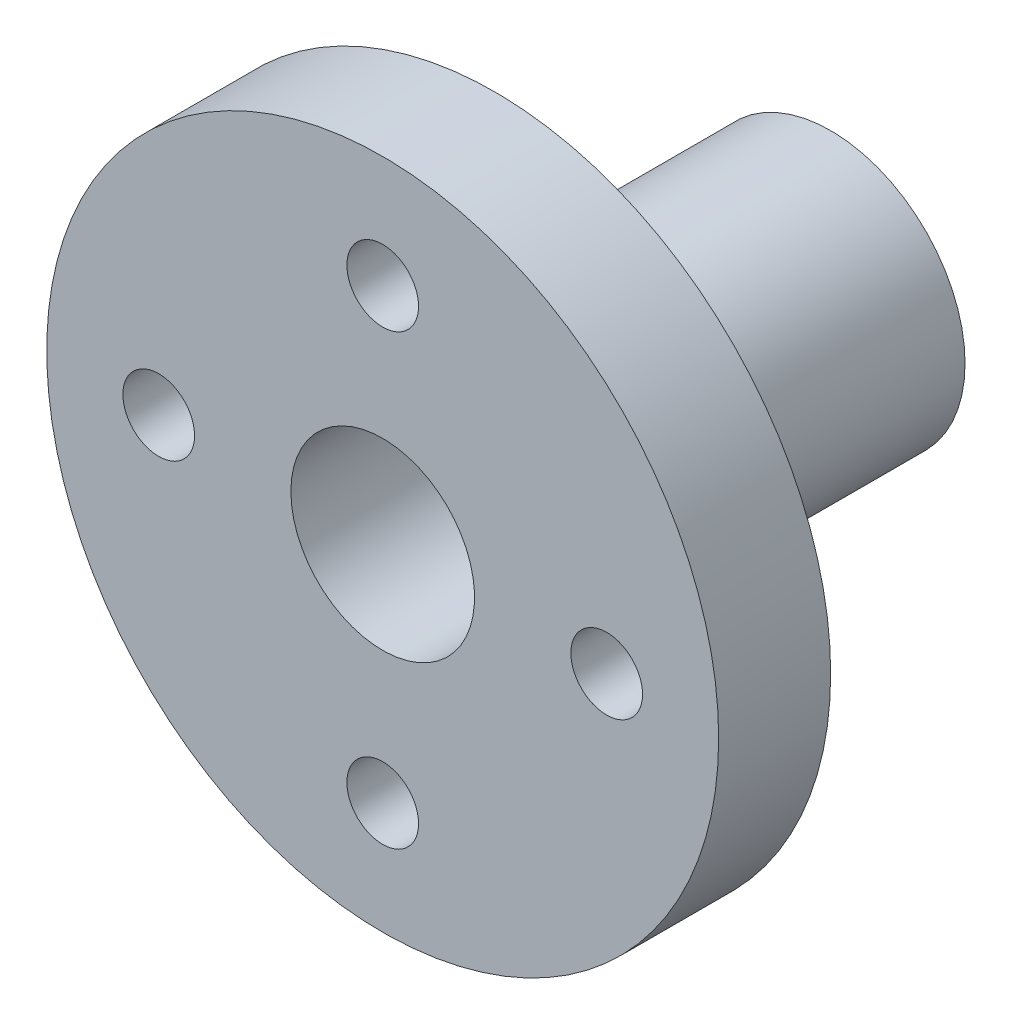
ISO-10303-21;
HEADER;
FILE_DESCRIPTION(('STEP AP214'),'2;1');
FILE_NAME('part.step','',(''),(''),'','','');
FILE_SCHEMA(('AUTOMOTIVE_DESIGN { 1 0 10303 214 1 1 1 1 }'));
ENDSEC;
DATA;
#1=APPLICATION_CONTEXT('core data for automotive mechanical design processes');
#2=APPLICATION_PROTOCOL_DEFINITION('international standard','automotive_design',2000,#1);
#3=PRODUCT_CONTEXT('',#1,'mechanical');
#4=PRODUCT('Part','Part','',(#3));
#5=PRODUCT_RELATED_PRODUCT_CATEGORY('part','',(#4));
#6=PRODUCT_DEFINITION_FORMATION('','',#4);
#7=PRODUCT_DEFINITION_CONTEXT('part definition',#1,'design');
#8=PRODUCT_DEFINITION('design','',#6,#7);
#9=PRODUCT_DEFINITION_SHAPE('','',#8);
#10=(LENGTH_UNIT() NAMED_UNIT(*) SI_UNIT(.MILLI.,.METRE.));
#11=(NAMED_UNIT(*) PLANE_ANGLE_UNIT() SI_UNIT($,.RADIAN.));
#12=(NAMED_UNIT(*) SI_UNIT($,.STERADIAN.) SOLID_ANGLE_UNIT());
#13=UNCERTAINTY_MEASURE_WITH_UNIT(LENGTH_MEASURE(1.E-05),#10,'distance_accuracy_value','');
#14=(GEOMETRIC_REPRESENTATION_CONTEXT(3) GLOBAL_UNCERTAINTY_ASSIGNED_CONTEXT((#13)) GLOBAL_UNIT_ASSIGNED_CONTEXT((#10,
#11,#12)) REPRESENTATION_CONTEXT('',''));
#15=CARTESIAN_POINT('',(0.,0.,0.));
#16=DIRECTION('',(0.,0.,1.));
#17=DIRECTION('',(1.,0.,0.));
#18=AXIS2_PLACEMENT_3D('',#15,#16,#17);
#19=CARTESIAN_POINT('',(-1.89397951347232,4.31163707788319,-15.));
#20=DIRECTION('',(0.,0.,1.));
#21=DIRECTION('',(1.,0.,0.));
#22=AXIS2_PLACEMENT_3D('',#19,#20,#21);
#23=CYLINDRICAL_SURFACE('',#22,6.);
#24=CARTESIAN_POINT('',(-1.89397951347232,-1.68836292211681,-6.89904165578189));
#25=CARTESIAN_POINT('',(-1.9821831581386,-1.68836159259811,-6.89903956223401));
#26=CARTESIAN_POINT('',(-2.07040924164979,-1.68639881141405,-6.89172356443015));
#27=CARTESIAN_POINT('',(-2.24431987455589,-1.67875951109007,-6.86270467119093));
#28=CARTESIAN_POINT('',(-2.33000318012759,-1.67308120477741,-6.840994852241));
#29=CARTESIAN_POINT('',(-2.49629278470857,-1.65863758813924,-6.78394432229066));
#30=CARTESIAN_POINT('',(-2.57690547428455,-1.64987625916019,-6.74862118564906));
#31=CARTESIAN_POINT('',(-2.73106246258645,-1.63019251532986,-6.66541186164861));
#32=CARTESIAN_POINT('',(-2.80460628983202,-1.61926995647686,-6.6175248370945));
#33=CARTESIAN_POINT('',(-2.94424311646434,-1.59615984133419,-6.50937484265115));
#34=CARTESIAN_POINT('',(-3.01014886536257,-1.58395066355161,-6.44887472137511));
#35=CARTESIAN_POINT('',(-3.1310092227574,-1.5597821995482,-6.31772286933137));
#36=CARTESIAN_POINT('',(-3.18596242143755,-1.54782294567479,-6.24706983368849));
#37=CARTESIAN_POINT('',(-3.28427078741973,-1.52528722185211,-6.09612306792089));
#38=CARTESIAN_POINT('',(-3.32741053536454,-1.51473803069915,-6.0156845931701));
#39=CARTESIAN_POINT('',(-3.39947989808795,-1.4965347405859,-5.84836956691035));
#40=CARTESIAN_POINT('',(-3.42841213308208,-1.48888010785762,-5.76149420592571));
#41=CARTESIAN_POINT('',(-3.47059487528372,-1.47755584881536,-5.58584522552057));
#42=CARTESIAN_POINT('',(-3.48418487543181,-1.47380010563927,-5.49715882382016));
#43=CARTESIAN_POINT('',(-3.49635579112106,-1.47044157047433,-5.31869150911556));
#44=CARTESIAN_POINT('',(-3.49493951111821,-1.47083800250404,-5.22891080375339));
#45=CARTESIAN_POINT('',(-3.47740759349329,-1.47566195226918,-5.05345332348399));
#46=CARTESIAN_POINT('',(-3.46170276199027,-1.47997680613833,-4.96773191015146));
#47=CARTESIAN_POINT('',(-3.41669750324995,-1.49197102683306,-4.80018698821653));
#48=CARTESIAN_POINT('',(-3.38739598941632,-1.49965066255677,-4.71836379172151));
#49=CARTESIAN_POINT('',(-3.31569436919432,-1.51760821608464,-4.55986714073513));
#50=CARTESIAN_POINT('',(-3.27315024257458,-1.52791446466127,-4.48326218435291));
#51=CARTESIAN_POINT('',(-3.17627154406255,-1.54994875926154,-4.33813432870064));
#52=CARTESIAN_POINT('',(-3.12193465126634,-1.56167708495971,-4.2696130244567));
#53=CARTESIAN_POINT('',(-3.00091237157967,-1.58570300715427,-4.14025045781805));
#54=CARTESIAN_POINT('',(-2.93388201529871,-1.59800669402707,-4.07973260112993));
#55=CARTESIAN_POINT('',(-2.79047364803742,-1.62145397232773,-3.97073063150166));
#56=CARTESIAN_POINT('',(-2.71409526883639,-1.63259751802536,-3.92224699281995));
#57=CARTESIAN_POINT('',(-2.55365811787028,-1.65253748530306,-3.83854733352217));
#58=CARTESIAN_POINT('',(-2.46956743551375,-1.66132350478527,-3.80338983942301));
#59=CARTESIAN_POINT('',(-2.29638134898464,-1.67548327732484,-3.74780390473119));
#60=CARTESIAN_POINT('',(-2.20728704301498,-1.68085777598681,-3.72737224560272));
#61=CARTESIAN_POINT('',(-2.02938277998873,-1.68747619058389,-3.70232575424763));
#62=CARTESIAN_POINT('',(-1.94063890358542,-1.68883490188451,-3.6972712239012));
#63=CARTESIAN_POINT('',(-1.76357147675136,-1.68759869565035,-3.70190818717944));
#64=CARTESIAN_POINT('',(-1.67524788382263,-1.68500418675956,-3.7115981566665));
#65=CARTESIAN_POINT('',(-1.50309755355089,-1.67622720608506,-3.74508841374987));
#66=CARTESIAN_POINT('',(-1.41921963185009,-1.67010713448775,-3.76864345274012));
#67=CARTESIAN_POINT('',(-1.25661393653147,-1.65497328126963,-3.82891041138823));
#68=CARTESIAN_POINT('',(-1.17788672209952,-1.64595918608501,-3.86562375678225));
#69=CARTESIAN_POINT('',(-1.02610873373793,-1.62576820659416,-3.95198076552639));
#70=CARTESIAN_POINT('',(-0.95319936270328,-1.61455241496068,-4.00186362922036));
#71=CARTESIAN_POINT('',(-0.816631805154697,-1.59125454103711,-4.11284295990801));
#72=CARTESIAN_POINT('',(-0.752975450433326,-1.57917228792125,-4.17394164186171));
#73=CARTESIAN_POINT('',(-0.63486811764177,-1.55508088906662,-4.30767011777859));
#74=CARTESIAN_POINT('',(-0.580727359472434,-1.54308341361245,-4.380576504902));
#75=CARTESIAN_POINT('',(-0.485441983992733,-1.52089449951751,-4.53469341265761));
#76=CARTESIAN_POINT('',(-0.444296824500106,-1.510702985539,-4.61590358666488));
#77=CARTESIAN_POINT('',(-0.376480220780432,-1.49339706933002,-4.78391790145246));
#78=CARTESIAN_POINT('',(-0.349725015425141,-1.48626490950668,-4.87068630528039));
#79=CARTESIAN_POINT('',(-0.311249872505976,-1.47588152397433,-5.04771311156895));
#80=CARTESIAN_POINT('',(-0.299526092648417,-1.47262930649938,-5.13797061607555));
#81=CARTESIAN_POINT('',(-0.291667596246297,-1.4704568784903,-5.31623748607993));
#82=CARTESIAN_POINT('',(-0.29503426852844,-1.47139810400507,-5.40422351198611));
#83=CARTESIAN_POINT('',(-0.316104505467822,-1.47718209082317,-5.57832446699232));
#84=CARTESIAN_POINT('',(-0.333807701191854,-1.48202475172772,-5.66443944418299));
#85=CARTESIAN_POINT('',(-0.382759387874988,-1.49498349068681,-5.83172625748513));
#86=CARTESIAN_POINT('',(-0.413902224867752,-1.50307400226987,-5.91293112996746));
#87=CARTESIAN_POINT('',(-0.488767076973164,-1.52161746721033,-6.06902472020937));
#88=CARTESIAN_POINT('',(-0.532491065275369,-1.53207079108884,-6.14391244482233));
#89=CARTESIAN_POINT('',(-0.632788239321806,-1.55454629363935,-6.28762594337913));
#90=CARTESIAN_POINT('',(-0.689701675329052,-1.56660558693003,-6.35620848376285));
#91=CARTESIAN_POINT('',(-0.814115085383516,-1.59072695238118,-6.48301161711576));
#92=CARTESIAN_POINT('',(-0.881617629985323,-1.60278902450443,-6.54122968671697));
#93=CARTESIAN_POINT('',(-1.02703552860138,-1.62586542134848,-6.64687544589937));
#94=CARTESIAN_POINT('',(-1.1051427440709,-1.6368518126332,-6.69404566430135));
#95=CARTESIAN_POINT('',(-1.26846860113881,-1.65623340294002,-6.77451158852538));
#96=CARTESIAN_POINT('',(-1.35368263771528,-1.66463026358558,-6.80781619631277));
#97=CARTESIAN_POINT('',(-1.51447974956753,-1.67680094222455,-6.8552618841143));
#98=CARTESIAN_POINT('',(-1.58936990022029,-1.68110508685763,-6.87164116265588));
#99=CARTESIAN_POINT('',(-1.74082767721866,-1.68688651440846,-6.89353142071554));
#100=CARTESIAN_POINT('',(-1.81739513714843,-1.68836407649497,-6.89904347354191));
#101=CARTESIAN_POINT('',(-1.89397951347232,-1.68836292211681,-6.89904165578189));
#102=B_SPLINE_CURVE_WITH_KNOTS('',3,(#24,#25,#26,#27,#28,#29,#30,#31,#32,#33,#34,#35,#36,#37,
#38,#39,#40,#41,#42,#43,#44,#45,#46,#47,#48,#49,#50,#51,#52,#53,#54,#55,#56,#57,#58,#59,#60,#61,
#62,#63,#64,#65,#66,#67,#68,#69,#70,#71,#72,#73,#74,#75,#76,#77,#78,#79,#80,#81,#82,#83,#84,#85,
#86,#87,#88,#89,#90,#91,#92,#93,#94,#95,#96,#97,#98,#99,#100,#101),.UNSPECIFIED.,.T.,.F.,(4,2,2,
2,2,2,2,2,2,2,2,2,2,2,2,2,2,2,2,2,2,2,2,2,2,2,2,2,2,2,2,2,2,2,2,2,2,2,4),(0.,0.264330079159656,
0.52878739500916,0.792904442377547,1.0570390936694,1.32667918363974,1.59635395940119,
1.87066066018583,2.1449167530376,2.41297726598071,2.68098768318787,2.94152801632129,
3.20208917445683,3.4655893867253,3.72914150489435,4.00129007845189,4.2734493754541,
4.54679047677765,4.82007181747443,5.08546174014969,5.35082423135612,5.61162828509024,
5.87246060615823,6.13840228798972,6.40439654602441,6.67789197101562,6.95137598414617,
7.2232503815319,7.49505526923061,7.75794673914764,8.0208314440835,8.28168612350517,
8.54258173690277,8.81115471648986,9.07979299457834,9.35417801816593,9.62838660908019,
9.85791855186544,10.0874278236498),.UNSPECIFIED.);
#103=CARTESIAN_POINT('',(-1.89397951347232,-1.68836292211681,-6.89904165578189));
#104=VERTEX_POINT('',#103);
#105=EDGE_CURVE('E85',#104,#104,#102,.T.);
#106=ORIENTED_EDGE('',*,*,#105,.T.);
#107=EDGE_LOOP('',(#106));
#108=FACE_BOUND('',#107,.T.);
#109=CARTESIAN_POINT('',(-1.89397951347232,4.31163707788319,-15.));
#110=DIRECTION('',(0.,0.,1.));
#111=DIRECTION('',(1.,0.,0.));
#112=AXIS2_PLACEMENT_3D('',#109,#110,#111);
#113=CIRCLE('',#112,6.);
#114=CARTESIAN_POINT('',(4.10602048652768,4.31163707788319,-15.));
#115=VERTEX_POINT('',#114);
#116=EDGE_CURVE('E152',#115,#115,#113,.T.);
#117=ORIENTED_EDGE('',*,*,#116,.T.);
#118=EDGE_LOOP('',(#117));
#119=FACE_BOUND('',#118,.T.);
#120=CARTESIAN_POINT('',(-1.89397951347232,4.31163707788319,0.));
#121=DIRECTION('',(0.,0.,1.));
#122=DIRECTION('',(1.,0.,0.));
#123=AXIS2_PLACEMENT_3D('',#120,#121,#122);
#124=CIRCLE('',#123,6.);
#125=CARTESIAN_POINT('',(4.10602048652768,4.31163707788319,0.));
#126=VERTEX_POINT('',#125);
#127=EDGE_CURVE('E132',#126,#126,#124,.T.);
#128=ORIENTED_EDGE('',*,*,#127,.F.);
#129=EDGE_LOOP('',(#128));
#130=FACE_BOUND('',#129,.T.);
#131=CARTESIAN_POINT('',(-1.89397951347232,10.3116370778832,-6.89904165578189));
#132=CARTESIAN_POINT('',(-1.80577586880604,10.3116357483645,-6.89903956223401));
#133=CARTESIAN_POINT('',(-1.71754978529485,10.3096729671804,-6.89172356443015));
#134=CARTESIAN_POINT('',(-1.54363915238875,10.3020336668564,-6.86270467119093));
#135=CARTESIAN_POINT('',(-1.45795584681705,10.2963553605438,-6.840994852241));
#136=CARTESIAN_POINT('',(-1.29166624223607,10.2819117439056,-6.78394432229066));
#137=CARTESIAN_POINT('',(-1.21105355266009,10.2731504149266,-6.74862118564906));
#138=CARTESIAN_POINT('',(-1.05689656435819,10.2534666710962,-6.66541186164861));
#139=CARTESIAN_POINT('',(-0.983352737112626,10.2425441122432,-6.6175248370945));
#140=CARTESIAN_POINT('',(-0.843715910480302,10.2194339971006,-6.50937484265115));
#141=CARTESIAN_POINT('',(-0.77781016158207,10.207224819318,-6.44887472137511));
#142=CARTESIAN_POINT('',(-0.656949804187241,10.1830563553146,-6.31772286933137));
#143=CARTESIAN_POINT('',(-0.601996605507088,10.1710971014412,-6.24706983368849));
#144=CARTESIAN_POINT('',(-0.503688239524915,10.1485613776185,-6.09612306792089));
#145=CARTESIAN_POINT('',(-0.460548491580104,10.1380121864655,-6.0156845931701));
#146=CARTESIAN_POINT('',(-0.388479128856687,10.1198088963523,-5.84836956691035));
#147=CARTESIAN_POINT('',(-0.359546893862559,10.112154263624,-5.76149420592571));
#148=CARTESIAN_POINT('',(-0.317364151660919,10.1008300045817,-5.58584522552057));
#149=CARTESIAN_POINT('',(-0.303774151512831,10.0970742614056,-5.49715882382016));
#150=CARTESIAN_POINT('',(-0.291603235823581,10.0937157262407,-5.31869150911556));
#151=CARTESIAN_POINT('',(-0.293019515826434,10.0941121582704,-5.22891080375339));
#152=CARTESIAN_POINT('',(-0.310551433451353,10.0989361080356,-5.05345332348399));
#153=CARTESIAN_POINT('',(-0.326256264954372,10.1032509619047,-4.96773191015146));
#154=CARTESIAN_POINT('',(-0.371261523694691,10.1152451825994,-4.80018698821653));
#155=CARTESIAN_POINT('',(-0.400563037528317,10.1229248183231,-4.71836379172151));
#156=CARTESIAN_POINT('',(-0.472264657750319,10.140882371851,-4.55986714073513));
#157=CARTESIAN_POINT('',(-0.514808784370058,10.1511886204276,-4.48326218435291));
#158=CARTESIAN_POINT('',(-0.611687482882088,10.1732229150279,-4.33813432870064));
#159=CARTESIAN_POINT('',(-0.666024375678306,10.1849512407261,-4.2696130244567));
#160=CARTESIAN_POINT('',(-0.787046655364973,10.2089771629206,-4.14025045781805));
#161=CARTESIAN_POINT('',(-0.854077011645929,10.2212808497934,-4.07973260112993));
#162=CARTESIAN_POINT('',(-0.997485378907223,10.2447281280941,-3.97073063150166));
#163=CARTESIAN_POINT('',(-1.07386375810825,10.2558716737917,-3.92224699281995));
#164=CARTESIAN_POINT('',(-1.23430090907436,10.2758116410694,-3.83854733352217));
#165=CARTESIAN_POINT('',(-1.31839159143089,10.2845976605516,-3.80338983942301));
#166=CARTESIAN_POINT('',(-1.49157767796,10.2987574330912,-3.74780390473119));
#167=CARTESIAN_POINT('',(-1.58067198392966,10.3041319317532,-3.72737224560272));
#168=CARTESIAN_POINT('',(-1.75857624695591,10.3107503463503,-3.70232575424763));
#169=CARTESIAN_POINT('',(-1.84732012335922,10.3121090576509,-3.6972712239012));
#170=CARTESIAN_POINT('',(-2.02438755019328,10.3108728514167,-3.70190818717944));
#171=CARTESIAN_POINT('',(-2.11271114312201,10.3082783425259,-3.7115981566665));
#172=CARTESIAN_POINT('',(-2.28486147339375,10.2995013618514,-3.74508841374987));
#173=CARTESIAN_POINT('',(-2.36873939509455,10.2933812902541,-3.76864345274012));
#174=CARTESIAN_POINT('',(-2.53134509041317,10.278247437036,-3.82891041138823));
#175=CARTESIAN_POINT('',(-2.61007230484512,10.2692333418514,-3.86562375678225));
#176=CARTESIAN_POINT('',(-2.76185029320671,10.2490423623605,-3.95198076552639));
#177=CARTESIAN_POINT('',(-2.83475966424136,10.237826570727,-4.00186362922036));
#178=CARTESIAN_POINT('',(-2.97132722178994,10.2145286968035,-4.11284295990801));
#179=CARTESIAN_POINT('',(-3.03498357651132,10.2024464436876,-4.17394164186171));
#180=CARTESIAN_POINT('',(-3.15309090930287,10.178355044833,-4.30767011777859));
#181=CARTESIAN_POINT('',(-3.20723166747221,10.1663575693788,-4.380576504902));
#182=CARTESIAN_POINT('',(-3.30251704295191,10.1441686552839,-4.53469341265761));
#183=CARTESIAN_POINT('',(-3.34366220244454,10.1339771413054,-4.61590358666488));
#184=CARTESIAN_POINT('',(-3.41147880616421,10.1166712250964,-4.78391790145246));
#185=CARTESIAN_POINT('',(-3.4382340115195,10.1095390652731,-4.87068630528039));
#186=CARTESIAN_POINT('',(-3.47670915443867,10.0991556797407,-5.04771311156895));
#187=CARTESIAN_POINT('',(-3.48843293429622,10.0959034622657,-5.13797061607555));
#188=CARTESIAN_POINT('',(-3.49629143069834,10.0937310342567,-5.31623748607993));
#189=CARTESIAN_POINT('',(-3.4929247584162,10.0946722597714,-5.40422351198611));
#190=CARTESIAN_POINT('',(-3.47185452147682,10.1004562465895,-5.57832446699232));
#191=CARTESIAN_POINT('',(-3.45415132575279,10.1052989074941,-5.66443944418299));
#192=CARTESIAN_POINT('',(-3.40519963906965,10.1182576464532,-5.83172625748513));
#193=CARTESIAN_POINT('',(-3.37405680207689,10.1263481580362,-5.91293112996746));
#194=CARTESIAN_POINT('',(-3.29919194997148,10.1448916229767,-6.06902472020937));
#195=CARTESIAN_POINT('',(-3.25546796166927,10.1553449468552,-6.14391244482233));
#196=CARTESIAN_POINT('',(-3.15517078762284,10.1778204494057,-6.28762594337913));
#197=CARTESIAN_POINT('',(-3.09825735161559,10.1898797426964,-6.35620848376285));
#198=CARTESIAN_POINT('',(-2.97384394156113,10.2140011081476,-6.48301161711576));
#199=CARTESIAN_POINT('',(-2.90634139695932,10.2260631802708,-6.54122968671697));
#200=CARTESIAN_POINT('',(-2.76092349834327,10.2491395771148,-6.64687544589937));
#201=CARTESIAN_POINT('',(-2.68281628287374,10.2601259683996,-6.69404566430135));
#202=CARTESIAN_POINT('',(-2.51949042580583,10.2795075587064,-6.77451158852538));
#203=CARTESIAN_POINT('',(-2.43427638922936,10.2879044193519,-6.80781619631277));
#204=CARTESIAN_POINT('',(-2.27347927737711,10.3000750979909,-6.8552618841143));
#205=CARTESIAN_POINT('',(-2.19858912672435,10.304379242624,-6.87164116265589));
#206=CARTESIAN_POINT('',(-2.04713134972598,10.3101606701748,-6.89353142071554));
#207=CARTESIAN_POINT('',(-1.97056388979621,10.3116382322613,-6.89904347354191));
#208=CARTESIAN_POINT('',(-1.89397951347232,10.3116370778832,-6.89904165578189));
#209=B_SPLINE_CURVE_WITH_KNOTS('',3,(#131,#132,#133,#134,#135,#136,#137,#138,#139,#140,#141,
#142,#143,#144,#145,#146,#147,#148,#149,#150,#151,#152,#153,#154,#155,#156,#157,#158,#159,#160,
#161,#162,#163,#164,#165,#166,#167,#168,#169,#170,#171,#172,#173,#174,#175,#176,#177,#178,#179,
#180,#181,#182,#183,#184,#185,#186,#187,#188,#189,#190,#191,#192,#193,#194,#195,#196,#197,#198,
#199,#200,#201,#202,#203,#204,#205,#206,#207,#208),.UNSPECIFIED.,.T.,.F.,(4,2,2,2,2,2,2,2,2,2,2,
2,2,2,2,2,2,2,2,2,2,2,2,2,2,2,2,2,2,2,2,2,2,2,2,2,2,2,4),(0.,0.264330079159655,0.52878739500916,
0.792904442377546,1.0570390936694,1.32667918363974,1.59635395940119,1.87066066018583,
2.1449167530376,2.41297726598071,2.68098768318787,2.94152801632129,3.20208917445683,
3.4655893867253,3.72914150489435,4.00129007845189,4.27344937545409,4.54679047677765,
4.82007181747443,5.08546174014969,5.35082423135612,5.61162828509024,5.87246060615823,
6.13840228798972,6.40439654602441,6.67789197101562,6.95137598414617,7.2232503815319,
7.49505526923061,7.75794673914764,8.0208314440835,8.28168612350517,8.54258173690277,
8.81115471648986,9.07979299457834,9.35417801816593,9.62838660908019,9.85791855186544,
10.0874278236498),.UNSPECIFIED.);
#210=CARTESIAN_POINT('',(-1.89397951347232,10.3116370778832,-6.89904165578189));
#211=VERTEX_POINT('',#210);
#212=EDGE_CURVE('E92',#211,#211,#209,.T.);
#213=ORIENTED_EDGE('',*,*,#212,.T.);
#214=EDGE_LOOP('',(#213));
#215=FACE_BOUND('',#214,.T.);
#216=ADVANCED_FACE('F41',(#108,#119,#130,#215),#23,.T.);
#217=CARTESIAN_POINT('',(-1.89397951347232,4.31163707788319,5.));
#218=DIRECTION('',(0.,0.,-1.));
#219=DIRECTION('',(-1.,0.,0.));
#220=AXIS2_PLACEMENT_3D('',#217,#218,#219);
#221=CYLINDRICAL_SURFACE('',#220,4.1);
#222=CARTESIAN_POINT('',(-1.89397951347232,4.31163707788319,5.));
#223=DIRECTION('',(0.,0.,-1.));
#224=DIRECTION('',(-1.,0.,0.));
#225=AXIS2_PLACEMENT_3D('',#222,#223,#224);
#226=CIRCLE('',#225,4.1);
#227=CARTESIAN_POINT('',(-5.99397951347232,4.31163707788319,5.));
#228=VERTEX_POINT('',#227);
#229=EDGE_CURVE('E188',#228,#228,#226,.T.);
#230=ORIENTED_EDGE('',*,*,#229,.F.);
#231=EDGE_LOOP('',(#230));
#232=FACE_BOUND('',#231,.T.);
#233=CARTESIAN_POINT('',(-1.89397951347232,4.31163707788319,-15.));
#234=DIRECTION('',(0.,0.,-1.));
#235=DIRECTION('',(-1.,0.,0.));
#236=AXIS2_PLACEMENT_3D('',#233,#234,#235);
#237=CIRCLE('',#236,4.1);
#238=CARTESIAN_POINT('',(-5.99397951347232,4.31163707788319,-15.));
#239=VERTEX_POINT('',#238);
#240=EDGE_CURVE('E190',#239,#239,#237,.T.);
#241=ORIENTED_EDGE('',*,*,#240,.T.);
#242=EDGE_LOOP('',(#241));
#243=FACE_BOUND('',#242,.T.);
#244=CARTESIAN_POINT('',(-1.89397951347232,0.211637077883187,-6.89904165578189));
#245=CARTESIAN_POINT('',(-1.98037637091913,0.21163370467381,-6.89904603952004));
#246=CARTESIAN_POINT('',(-2.06674454090073,0.214391121026827,-6.89202233995114));
#247=CARTESIAN_POINT('',(-2.23688615051056,0.225113564792408,-6.86423809402297));
#248=CARTESIAN_POINT('',(-2.3206601888587,0.233077381054225,-6.84348074247254));
#249=CARTESIAN_POINT('',(-2.48313388226532,0.253362061568995,-6.78908426630173));
#250=CARTESIAN_POINT('',(-2.56184344351218,0.265674094160132,-6.75547124144452));
#251=CARTESIAN_POINT('',(-2.71249652537494,0.293440359504574,-6.67645604927439));
#252=CARTESIAN_POINT('',(-2.78443807615812,0.308895502949017,-6.63105046410295));
#253=CARTESIAN_POINT('',(-2.92278148415742,0.342148886606546,-6.52758963389405));
#254=CARTESIAN_POINT('',(-2.98883592581513,0.360017152902201,-6.46909258373084));
#255=CARTESIAN_POINT('',(-3.11048215961162,0.39575299530427,-6.34204728048522));
#256=CARTESIAN_POINT('',(-3.16607035168343,0.413620569067321,-6.27349558328593));
#257=CARTESIAN_POINT('',(-3.26750786140524,0.448165038313724,-6.12478562510281));
#258=CARTESIAN_POINT('',(-3.31285073521172,0.464760527655482,-6.04426107620812));
#259=CARTESIAN_POINT('',(-3.38919399417374,0.493782418507485,-5.87598127529315));
#260=CARTESIAN_POINT('',(-3.42020065019954,0.506210642185411,-5.78822920452292));
#261=CARTESIAN_POINT('',(-3.46559389348772,0.524737406355593,-5.61199610642381));
#262=CARTESIAN_POINT('',(-3.48064728623239,0.531088714996237,-5.52371434568867));
#263=CARTESIAN_POINT('',(-3.49579060581493,0.537478132054011,-5.34566683570553));
#264=CARTESIAN_POINT('',(-3.49588739000379,0.537519133639709,-5.2559017854006));
#265=CARTESIAN_POINT('',(-3.4816217600914,0.531499814845938,-5.0837180801515));
#266=CARTESIAN_POINT('',(-3.46820849758736,0.525840005565785,-5.0012041138762));
#267=CARTESIAN_POINT('',(-3.42888078932825,0.509726390683055,-4.83970746853703));
#268=CARTESIAN_POINT('',(-3.40296429752433,0.499271800468522,-4.76072536974598));
#269=CARTESIAN_POINT('',(-3.33888148757101,0.474521772720795,-4.6066850228225));
#270=CARTESIAN_POINT('',(-3.30048220911143,0.460154209762037,-4.53173579198958));
#271=CARTESIAN_POINT('',(-3.21268686092847,0.429218587826193,-4.38907883956883));
#272=CARTESIAN_POINT('',(-3.16328678206911,0.412649727497736,-4.32137377139833));
#273=CARTESIAN_POINT('',(-3.05063518272254,0.377699035859086,-4.18990793914183));
#274=CARTESIAN_POINT('',(-2.98663402449033,0.359273313007651,-4.12679953640577));
#275=CARTESIAN_POINT('',(-2.84875394702239,0.323721583482935,-4.01200853288572));
#276=CARTESIAN_POINT('',(-2.77487325142956,0.306595811413059,-3.9603279912947));
#277=CARTESIAN_POINT('',(-2.61755520725803,0.275180999709424,-3.86905882397697));
#278=CARTESIAN_POINT('',(-2.53396986951844,0.260948523331101,-3.82970440862988));
#279=CARTESIAN_POINT('',(-2.36066977753357,0.237348215613636,-3.76583697738073));
#280=CARTESIAN_POINT('',(-2.27095800431274,0.227978037177028,-3.74131679984008));
#281=CARTESIAN_POINT('',(-2.09342873963127,0.215579878154762,-3.70910726990265));
#282=CARTESIAN_POINT('',(-2.00579338619387,0.212221699467578,-3.70054052443409));
#283=CARTESIAN_POINT('',(-1.83028212827952,0.211193627829418,-3.69790455667041));
#284=CARTESIAN_POINT('',(-1.74240628772512,0.213522346923168,-3.70383179694556));
#285=CARTESIAN_POINT('',(-1.57281154920428,0.223389473552933,-3.72936146784672));
#286=CARTESIAN_POINT('',(-1.49098946812246,0.230703259133146,-3.74837460849613));
#287=CARTESIAN_POINT('',(-1.33176511404439,0.249575109959044,-3.7987448585453));
#288=CARTESIAN_POINT('',(-1.25436341411959,0.261133724080189,-3.83010356432004));
#289=CARTESIAN_POINT('',(-1.10355265853873,0.287799430397192,-3.9052915805992));
#290=CARTESIAN_POINT('',(-1.03033462755793,0.303003096483888,-3.94946872401745));
#291=CARTESIAN_POINT('',(-0.892097820644403,0.335297008570194,-4.04865101309864));
#292=CARTESIAN_POINT('',(-0.827082252596533,0.352387987805268,-4.10366037370671));
#293=CARTESIAN_POINT('',(-0.702812803273328,0.387919534868471,-4.22700693314846));
#294=CARTESIAN_POINT('',(-0.644178119796022,0.406377398180134,-4.29596461084646));
#295=CARTESIAN_POINT('',(-0.539172468641299,0.441550148872679,-4.44308269190222));
#296=CARTESIAN_POINT('',(-0.492803131136543,0.458264804387229,-4.52124431655261));
#297=CARTESIAN_POINT('',(-0.413455768115124,0.4880435048354,-4.68550699162776));
#298=CARTESIAN_POINT('',(-0.380578634918819,0.501079825558988,-4.77166215561816));
#299=CARTESIAN_POINT('',(-0.330038411272943,0.521538679988601,-4.94894389073489));
#300=CARTESIAN_POINT('',(-0.312364823743774,0.528965086550478,-5.04006698552363));
#301=CARTESIAN_POINT('',(-0.293711166136131,0.536821311149216,-5.21792724083086));
#302=CARTESIAN_POINT('',(-0.291663951284171,0.537698300401134,-5.30453351760027));
#303=CARTESIAN_POINT('',(-0.301545818664154,0.533518044080752,-5.47679057941558));
#304=CARTESIAN_POINT('',(-0.313473331289518,0.528461464951973,-5.5624414706773));
#305=CARTESIAN_POINT('',(-0.350110109075191,0.513369657160304,-5.72722421511421));
#306=CARTESIAN_POINT('',(-0.374346284183947,0.503519229674296,-5.80647968235944));
#307=CARTESIAN_POINT('',(-0.434480168462741,0.480071090717,-5.95983695651584));
#308=CARTESIAN_POINT('',(-0.470380933523158,0.466472397416423,-6.0339374067321));
#309=CARTESIAN_POINT('',(-0.555128122386443,0.436123332965855,-6.17935202199271));
#310=CARTESIAN_POINT('',(-0.60458172388298,0.419240063626564,-6.25028418803952));
#311=CARTESIAN_POINT('',(-0.714122953196634,0.384649016958068,-6.38318187844119));
#312=CARTESIAN_POINT('',(-0.774214098401576,0.366940968340657,-6.44514442456375));
#313=CARTESIAN_POINT('',(-0.907664405461979,0.331407947023648,-6.56218178909964));
#314=CARTESIAN_POINT('',(-0.98160651482633,0.313640777516633,-6.61661266693997));
#315=CARTESIAN_POINT('',(-1.13821737115333,0.281101435801768,-6.71228099174658));
#316=CARTESIAN_POINT('',(-1.22088805998284,0.266329932190446,-6.75351549462547));
#317=CARTESIAN_POINT('',(-1.39951330882463,0.240488583764652,-6.82397378082285));
#318=CARTESIAN_POINT('',(-1.49600119866597,0.229800021349013,-6.85200161858203));
#319=CARTESIAN_POINT('',(-1.6930005128853,0.215378379836604,-6.88952727904041));
#320=CARTESIAN_POINT('',(-1.79350941042082,0.21164100055704,-6.8990365579735));
#321=CARTESIAN_POINT('',(-1.89397951347232,0.211637077883187,-6.89904165578189));
#322=B_SPLINE_CURVE_WITH_KNOTS('',3,(#244,#245,#246,#247,#248,#249,#250,#251,#252,#253,#254,
#255,#256,#257,#258,#259,#260,#261,#262,#263,#264,#265,#266,#267,#268,#269,#270,#271,#272,#273,
#274,#275,#276,#277,#278,#279,#280,#281,#282,#283,#284,#285,#286,#287,#288,#289,#290,#291,#292,
#293,#294,#295,#296,#297,#298,#299,#300,#301,#302,#303,#304,#305,#306,#307,#308,#309,#310,#311,
#312,#313,#314,#315,#316,#317,#318,#319,#320,#321),.UNSPECIFIED.,.T.,.F.,(4,2,2,2,2,2,2,2,2,2,2,
2,2,2,2,2,2,2,2,2,2,2,2,2,2,2,2,2,2,2,2,2,2,2,2,2,2,2,4),(0.,0.25881970802216,0.517579228928641,
0.775816177676649,1.03412805538057,1.30301613547217,1.57199653647335,1.85226204394674,
2.13240484295991,2.40031100869251,2.66809434363398,2.91829172726607,3.16853006750118,
3.42373592732404,3.67903494712588,3.95303766408761,4.22708971359851,4.50607099532339,
4.78491748341413,5.04791536154827,5.31084905832673,5.5626565075919,5.81449652816566,
6.07393785644212,6.33348033663664,6.60933983572724,6.88523598057687,7.16315920121911,
7.4408903792196,7.69946909380634,7.95801876825994,8.20730825870159,8.45666311075805,
8.71983704321138,8.98309815930305,9.26229452610694,9.54155313776344,9.84271854305256,
10.143697577536),.UNSPECIFIED.);
#323=CARTESIAN_POINT('',(-1.89397951347232,0.211637077883187,-6.89904165578189));
#324=VERTEX_POINT('',#323);
#325=EDGE_CURVE('E66',#324,#324,#322,.T.);
#326=ORIENTED_EDGE('',*,*,#325,.F.);
#327=EDGE_LOOP('',(#326));
#328=FACE_BOUND('',#327,.T.);
#329=CARTESIAN_POINT('',(-1.89397951347232,8.41163707788319,-6.89904165578189));
#330=CARTESIAN_POINT('',(-1.80758265602551,8.41164045109256,-6.89904603952004));
#331=CARTESIAN_POINT('',(-1.72121448604392,8.40888303473955,-6.89202233995114));
#332=CARTESIAN_POINT('',(-1.55107287643408,8.39816059097396,-6.86423809402297));
#333=CARTESIAN_POINT('',(-1.46729883808594,8.39019677471215,-6.84348074247254));
#334=CARTESIAN_POINT('',(-1.30482514467932,8.36991209419737,-6.78908426630173));
#335=CARTESIAN_POINT('',(-1.22611558343246,8.35760006160624,-6.75547124144452));
#336=CARTESIAN_POINT('',(-1.0754625015697,8.3298337962618,-6.67645604927439));
#337=CARTESIAN_POINT('',(-1.00352095078652,8.31437865281735,-6.63105046410295));
#338=CARTESIAN_POINT('',(-0.865177542787224,8.28112526915982,-6.52758963389405));
#339=CARTESIAN_POINT('',(-0.799123101129513,8.26325700286417,-6.46909258373084));
#340=CARTESIAN_POINT('',(-0.677476867333019,8.2275211604621,-6.34204728048522));
#341=CARTESIAN_POINT('',(-0.621888675261213,8.20965358669905,-6.27349558328593));
#342=CARTESIAN_POINT('',(-0.520451165539406,8.17510911745265,-6.12478562510281));
#343=CARTESIAN_POINT('',(-0.475108291732925,8.15851362811089,-6.04426107620812));
#344=CARTESIAN_POINT('',(-0.398765032770903,8.12949173725888,-5.87598127529315));
#345=CARTESIAN_POINT('',(-0.367758376745101,8.11706351358096,-5.78822920452291));
#346=CARTESIAN_POINT('',(-0.322365133456919,8.09853674941078,-5.61199610642381));
#347=CARTESIAN_POINT('',(-0.307311740712252,8.09218544077013,-5.52371434568867));
#348=CARTESIAN_POINT('',(-0.292168421129707,8.08579602371236,-5.34566683570553));
#349=CARTESIAN_POINT('',(-0.292071636940847,8.08575502212666,-5.2559017854006));
#350=CARTESIAN_POINT('',(-0.306337266853237,8.09177434092043,-5.0837180801515));
#351=CARTESIAN_POINT('',(-0.319750529357286,8.09743415020058,-5.0012041138762));
#352=CARTESIAN_POINT('',(-0.359078237616396,8.11354776508331,-4.83970746853703));
#353=CARTESIAN_POINT('',(-0.384994729420315,8.12400235529785,-4.76072536974598));
#354=CARTESIAN_POINT('',(-0.449077539373627,8.14875238304558,-4.6066850228225));
#355=CARTESIAN_POINT('',(-0.487476817833214,8.16311994600433,-4.53173579198957));
#356=CARTESIAN_POINT('',(-0.575272166016168,8.19405556794018,-4.38907883956883));
#357=CARTESIAN_POINT('',(-0.624672244875532,8.21062442826863,-4.32137377139833));
#358=CARTESIAN_POINT('',(-0.737323844222102,8.24557511990728,-4.18990793914182));
#359=CARTESIAN_POINT('',(-0.801325002454313,8.26400084275872,-4.12679953640577));
#360=CARTESIAN_POINT('',(-0.939205079922255,8.29955257228343,-4.01200853288572));
#361=CARTESIAN_POINT('',(-1.01308577551508,8.31667834435331,-3.9603279912947));
#362=CARTESIAN_POINT('',(-1.17040381968661,8.34809315605695,-3.86905882397697));
#363=CARTESIAN_POINT('',(-1.2539891574262,8.36232563243527,-3.82970440862988));
#364=CARTESIAN_POINT('',(-1.42728924941107,8.38592594015273,-3.76583697738073));
#365=CARTESIAN_POINT('',(-1.5170010226319,8.39529611858934,-3.74131679984008));
#366=CARTESIAN_POINT('',(-1.69453028731337,8.40769427761161,-3.70910726990265));
#367=CARTESIAN_POINT('',(-1.78216564075077,8.41105245629879,-3.70054052443409));
#368=CARTESIAN_POINT('',(-1.95767689866512,8.41208052793695,-3.69790455667041));
#369=CARTESIAN_POINT('',(-2.04555273921952,8.4097518088432,-3.70383179694556));
#370=CARTESIAN_POINT('',(-2.21514747774036,8.39988468221344,-3.72936146784672));
#371=CARTESIAN_POINT('',(-2.29696955882219,8.39257089663322,-3.74837460849613));
#372=CARTESIAN_POINT('',(-2.45619391290025,8.37369904580732,-3.7987448585453));
#373=CARTESIAN_POINT('',(-2.53359561282505,8.36214043168618,-3.83010356432004));
#374=CARTESIAN_POINT('',(-2.68440636840591,8.33547472536918,-3.9052915805992));
#375=CARTESIAN_POINT('',(-2.75762439938671,8.32027105928248,-3.94946872401745));
#376=CARTESIAN_POINT('',(-2.89586120630024,8.28797714719618,-4.04865101309864));
#377=CARTESIAN_POINT('',(-2.96087677434811,8.2708861679611,-4.10366037370671));
#378=CARTESIAN_POINT('',(-3.08514622367131,8.2353546208979,-4.22700693314846));
#379=CARTESIAN_POINT('',(-3.14378090714862,8.21689675758624,-4.29596461084646));
#380=CARTESIAN_POINT('',(-3.24878655830334,8.18172400689369,-4.44308269190222));
#381=CARTESIAN_POINT('',(-3.2951558958081,8.16500935137914,-4.52124431655261));
#382=CARTESIAN_POINT('',(-3.37450325882952,8.13523065093097,-4.68550699162776));
#383=CARTESIAN_POINT('',(-3.40738039202582,8.12219433020738,-4.77166215561816));
#384=CARTESIAN_POINT('',(-3.4579206156717,8.10173547577777,-4.94894389073489));
#385=CARTESIAN_POINT('',(-3.47559420320087,8.09430906921589,-5.04006698552363));
#386=CARTESIAN_POINT('',(-3.49424786080851,8.08645284461715,-5.21792724083086));
#387=CARTESIAN_POINT('',(-3.49629507566047,8.08557585536524,-5.30453351760027));
#388=CARTESIAN_POINT('',(-3.48641320828049,8.08975611168562,-5.47679057941558));
#389=CARTESIAN_POINT('',(-3.47448569565512,8.0948126908144,-5.5624414706773));
#390=CARTESIAN_POINT('',(-3.43784891786945,8.10990449860607,-5.72722421511421));
#391=CARTESIAN_POINT('',(-3.41361274276069,8.11975492609208,-5.80647968235943));
#392=CARTESIAN_POINT('',(-3.3534788584819,8.14320306504937,-5.95983695651584));
#393=CARTESIAN_POINT('',(-3.31757809342148,8.15680175834995,-6.0339374067321));
#394=CARTESIAN_POINT('',(-3.2328309045582,8.18715082280052,-6.17935202199271));
#395=CARTESIAN_POINT('',(-3.18337730306166,8.20403409213981,-6.25028418803952));
#396=CARTESIAN_POINT('',(-3.07383607374801,8.2386251388083,-6.38318187844119));
#397=CARTESIAN_POINT('',(-3.01374492854307,8.25633318742571,-6.44514442456375));
#398=CARTESIAN_POINT('',(-2.88029462148266,8.29186620874272,-6.56218178909964));
#399=CARTESIAN_POINT('',(-2.80635251211831,8.30963337824974,-6.61661266693997));
#400=CARTESIAN_POINT('',(-2.64974165579131,8.3421727199646,-6.71228099174657));
#401=CARTESIAN_POINT('',(-2.5670709669618,8.35694422357592,-6.75351549462547));
#402=CARTESIAN_POINT('',(-2.38844571812002,8.38278557200172,-6.82397378082285));
#403=CARTESIAN_POINT('',(-2.29195782827867,8.39347413441736,-6.85200161858202));
#404=CARTESIAN_POINT('',(-2.09495851405934,8.40789577592977,-6.88952727904041));
#405=CARTESIAN_POINT('',(-1.99444961652382,8.41163315520933,-6.8990365579735));
#406=CARTESIAN_POINT('',(-1.89397951347232,8.41163707788319,-6.89904165578189));
#407=B_SPLINE_CURVE_WITH_KNOTS('',3,(#329,#330,#331,#332,#333,#334,#335,#336,#337,#338,#339,
#340,#341,#342,#343,#344,#345,#346,#347,#348,#349,#350,#351,#352,#353,#354,#355,#356,#357,#358,
#359,#360,#361,#362,#363,#364,#365,#366,#367,#368,#369,#370,#371,#372,#373,#374,#375,#376,#377,
#378,#379,#380,#381,#382,#383,#384,#385,#386,#387,#388,#389,#390,#391,#392,#393,#394,#395,#396,
#397,#398,#399,#400,#401,#402,#403,#404,#405,#406),.UNSPECIFIED.,.T.,.F.,(4,2,2,2,2,2,2,2,2,2,2,
2,2,2,2,2,2,2,2,2,2,2,2,2,2,2,2,2,2,2,2,2,2,2,2,2,2,2,4),(0.,0.25881970802216,0.517579228928641,
0.77581617767665,1.03412805538057,1.30301613547217,1.57199653647335,1.85226204394674,
2.13240484295992,2.40031100869251,2.66809434363398,2.91829172726607,3.16853006750118,
3.42373592732404,3.67903494712588,3.95303766408761,4.22708971359851,4.50607099532339,
4.78491748341413,5.04791536154827,5.31084905832673,5.5626565075919,5.81449652816566,
6.07393785644212,6.33348033663664,6.60933983572724,6.88523598057687,7.16315920121912,
7.4408903792196,7.69946909380634,7.95801876825994,8.20730825870159,8.45666311075805,
8.71983704321138,8.98309815930305,9.26229452610694,9.54155313776344,9.84271854305257,
10.143697577536),.UNSPECIFIED.);
#408=CARTESIAN_POINT('',(-1.89397951347232,8.41163707788319,-6.89904165578189));
#409=VERTEX_POINT('',#408);
#410=EDGE_CURVE('E45',#409,#409,#407,.T.);
#411=ORIENTED_EDGE('',*,*,#410,.F.);
#412=EDGE_LOOP('',(#411));
#413=FACE_BOUND('',#412,.T.);
#414=ADVANCED_FACE('F72',(#232,#243,#328,#413),#221,.F.);
#415=CARTESIAN_POINT('',(-1.89397951347232,4.31163707788319,5.));
#416=DIRECTION('',(0.,0.,1.));
#417=DIRECTION('',(1.,0.,0.));
#418=AXIS2_PLACEMENT_3D('',#415,#416,#417);
#419=PLANE('',#418);
#420=ORIENTED_EDGE('',*,*,#229,.T.);
#421=EDGE_LOOP('',(#420));
#422=FACE_BOUND('',#421,.T.);
#423=CARTESIAN_POINT('',(-1.89397951347232,-5.68836292211682,5.));
#424=DIRECTION('',(0.,0.,1.));
#425=DIRECTION('',(1.,0.,0.));
#426=AXIS2_PLACEMENT_3D('',#423,#424,#425);
#427=CIRCLE('',#426,1.6);
#428=CARTESIAN_POINT('',(-0.293979513472321,-5.68836292211682,5.));
#429=VERTEX_POINT('',#428);
#430=EDGE_CURVE('E162',#429,#429,#427,.T.);
#431=ORIENTED_EDGE('',*,*,#430,.F.);
#432=EDGE_LOOP('',(#431));
#433=FACE_BOUND('',#432,.T.);
#434=CARTESIAN_POINT('',(-1.89397951347232,14.3116370778832,5.));
#435=DIRECTION('',(0.,0.,1.));
#436=DIRECTION('',(1.,0.,0.));
#437=AXIS2_PLACEMENT_3D('',#434,#435,#436);
#438=CIRCLE('',#437,1.6);
#439=CARTESIAN_POINT('',(-0.293979513472322,14.3116370778832,5.));
#440=VERTEX_POINT('',#439);
#441=EDGE_CURVE('E61',#440,#440,#438,.T.);
#442=ORIENTED_EDGE('',*,*,#441,.F.);
#443=EDGE_LOOP('',(#442));
#444=FACE_BOUND('',#443,.T.);
#445=CARTESIAN_POINT('',(-1.89397951347232,4.31163707788319,5.));
#446=DIRECTION('',(0.,0.,1.));
#447=DIRECTION('',(1.,0.,0.));
#448=AXIS2_PLACEMENT_3D('',#445,#446,#447);
#449=CIRCLE('',#448,15.);
#450=CARTESIAN_POINT('',(13.1060204865277,4.31163707788319,5.));
#451=VERTEX_POINT('',#450);
#452=EDGE_CURVE('E10',#451,#451,#449,.T.);
#453=ORIENTED_EDGE('',*,*,#452,.T.);
#454=EDGE_LOOP('',(#453));
#455=FACE_BOUND('',#454,.T.);
#456=CARTESIAN_POINT('',(8.10602048652768,4.31163707788319,5.));
#457=DIRECTION('',(0.,0.,1.));
#458=DIRECTION('',(1.,0.,0.));
#459=AXIS2_PLACEMENT_3D('',#456,#457,#458);
#460=CIRCLE('',#459,1.6);
#461=CARTESIAN_POINT('',(9.70602048652768,4.31163707788319,5.));
#462=VERTEX_POINT('',#461);
#463=EDGE_CURVE('E168',#462,#462,#460,.T.);
#464=ORIENTED_EDGE('',*,*,#463,.F.);
#465=EDGE_LOOP('',(#464));
#466=FACE_BOUND('',#465,.T.);
#467=CARTESIAN_POINT('',(-11.8939795134723,4.31163707788319,5.));
#468=DIRECTION('',(0.,0.,1.));
#469=DIRECTION('',(1.,0.,0.));
#470=AXIS2_PLACEMENT_3D('',#467,#468,#469);
#471=CIRCLE('',#470,1.6);
#472=CARTESIAN_POINT('',(-10.2939795134723,4.31163707788319,5.));
#473=VERTEX_POINT('',#472);
#474=EDGE_CURVE('E151',#473,#473,#471,.T.);
#475=ORIENTED_EDGE('',*,*,#474,.F.);
#476=EDGE_LOOP('',(#475));
#477=FACE_BOUND('',#476,.T.);
#478=ADVANCED_FACE('F119',(#422,#433,#444,#455,#466,#477),#419,.T.);
#479=CARTESIAN_POINT('',(-1.89397951347232,4.31163707788319,0.));
#480=DIRECTION('',(0.,0.,1.));
#481=DIRECTION('',(1.,0.,0.));
#482=AXIS2_PLACEMENT_3D('',#479,#480,#481);
#483=PLANE('',#482);
#484=ORIENTED_EDGE('',*,*,#127,.T.);
#485=EDGE_LOOP('',(#484));
#486=FACE_BOUND('',#485,.T.);
#487=CARTESIAN_POINT('',(-1.89397951347232,4.31163707788319,0.));
#488=DIRECTION('',(0.,0.,1.));
#489=DIRECTION('',(1.,0.,0.));
#490=AXIS2_PLACEMENT_3D('',#487,#488,#489);
#491=CIRCLE('',#490,15.);
#492=CARTESIAN_POINT('',(13.1060204865277,4.31163707788319,0.));
#493=VERTEX_POINT('',#492);
#494=EDGE_CURVE('E55',#493,#493,#491,.T.);
#495=ORIENTED_EDGE('',*,*,#494,.F.);
#496=EDGE_LOOP('',(#495));
#497=FACE_BOUND('',#496,.T.);
#498=CARTESIAN_POINT('',(-1.89397951347232,14.3116370778832,0.));
#499=DIRECTION('',(0.,0.,1.));
#500=DIRECTION('',(1.,0.,0.));
#501=AXIS2_PLACEMENT_3D('',#498,#499,#500);
#502=CIRCLE('',#501,1.6);
#503=CARTESIAN_POINT('',(-0.293979513472322,14.3116370778832,0.));
#504=VERTEX_POINT('',#503);
#505=EDGE_CURVE('E64',#504,#504,#502,.T.);
#506=ORIENTED_EDGE('',*,*,#505,.T.);
#507=EDGE_LOOP('',(#506));
#508=FACE_BOUND('',#507,.T.);
#509=CARTESIAN_POINT('',(8.10602048652768,4.31163707788319,0.));
#510=DIRECTION('',(0.,0.,1.));
#511=DIRECTION('',(1.,0.,0.));
#512=AXIS2_PLACEMENT_3D('',#509,#510,#511);
#513=CIRCLE('',#512,1.6);
#514=CARTESIAN_POINT('',(9.70602048652768,4.31163707788319,0.));
#515=VERTEX_POINT('',#514);
#516=EDGE_CURVE('E141',#515,#515,#513,.T.);
#517=ORIENTED_EDGE('',*,*,#516,.T.);
#518=EDGE_LOOP('',(#517));
#519=FACE_BOUND('',#518,.T.);
#520=CARTESIAN_POINT('',(-1.89397951347232,-5.68836292211682,0.));
#521=DIRECTION('',(0.,0.,1.));
#522=DIRECTION('',(1.,0.,0.));
#523=AXIS2_PLACEMENT_3D('',#520,#521,#522);
#524=CIRCLE('',#523,1.6);
#525=CARTESIAN_POINT('',(-0.293979513472321,-5.68836292211682,0.));
#526=VERTEX_POINT('',#525);
#527=EDGE_CURVE('E145',#526,#526,#524,.T.);
#528=ORIENTED_EDGE('',*,*,#527,.T.);
#529=EDGE_LOOP('',(#528));
#530=FACE_BOUND('',#529,.T.);
#531=CARTESIAN_POINT('',(-11.8939795134723,4.31163707788319,0.));
#532=DIRECTION('',(0.,0.,1.));
#533=DIRECTION('',(1.,0.,0.));
#534=AXIS2_PLACEMENT_3D('',#531,#532,#533);
#535=CIRCLE('',#534,1.6);
#536=CARTESIAN_POINT('',(-10.2939795134723,4.31163707788319,0.));
#537=VERTEX_POINT('',#536);
#538=EDGE_CURVE('E148',#537,#537,#535,.T.);
#539=ORIENTED_EDGE('',*,*,#538,.T.);
#540=EDGE_LOOP('',(#539));
#541=FACE_BOUND('',#540,.T.);
#542=ADVANCED_FACE('F121',(#486,#497,#508,#519,#530,#541),#483,.F.);
#543=CARTESIAN_POINT('',(-1.89397951347232,4.31163707788319,5.));
#544=DIRECTION('',(0.,0.,-1.));
#545=DIRECTION('',(-1.,0.,0.));
#546=AXIS2_PLACEMENT_3D('',#543,#544,#545);
#547=CYLINDRICAL_SURFACE('',#546,15.);
#548=ORIENTED_EDGE('',*,*,#452,.F.);
#549=EDGE_LOOP('',(#548));
#550=FACE_BOUND('',#549,.T.);
#551=ORIENTED_EDGE('',*,*,#494,.T.);
#552=EDGE_LOOP('',(#551));
#553=FACE_BOUND('',#552,.T.);
#554=ADVANCED_FACE('F43',(#550,#553),#547,.T.);
#555=CARTESIAN_POINT('',(-1.89397951347232,14.3116370778832,5.));
#556=DIRECTION('',(0.,0.,-1.));
#557=DIRECTION('',(-1.,0.,0.));
#558=AXIS2_PLACEMENT_3D('',#555,#556,#557);
#559=CYLINDRICAL_SURFACE('',#558,1.6);
#560=ORIENTED_EDGE('',*,*,#441,.T.);
#561=EDGE_LOOP('',(#560));
#562=FACE_BOUND('',#561,.T.);
#563=ORIENTED_EDGE('',*,*,#505,.F.);
#564=EDGE_LOOP('',(#563));
#565=FACE_BOUND('',#564,.T.);
#566=ADVANCED_FACE('F114',(#562,#565),#559,.F.);
#567=CARTESIAN_POINT('',(8.10602048652768,4.31163707788319,5.));
#568=DIRECTION('',(0.,0.,-1.));
#569=DIRECTION('',(-1.,0.,0.));
#570=AXIS2_PLACEMENT_3D('',#567,#568,#569);
#571=CYLINDRICAL_SURFACE('',#570,1.6);
#572=ORIENTED_EDGE('',*,*,#463,.T.);
#573=EDGE_LOOP('',(#572));
#574=FACE_BOUND('',#573,.T.);
#575=ORIENTED_EDGE('',*,*,#516,.F.);
#576=EDGE_LOOP('',(#575));
#577=FACE_BOUND('',#576,.T.);
#578=ADVANCED_FACE('F110',(#574,#577),#571,.F.);
#579=CARTESIAN_POINT('',(-1.89397951347232,-5.68836292211682,5.));
#580=DIRECTION('',(0.,0.,-1.));
#581=DIRECTION('',(-1.,0.,0.));
#582=AXIS2_PLACEMENT_3D('',#579,#580,#581);
#583=CYLINDRICAL_SURFACE('',#582,1.6);
#584=ORIENTED_EDGE('',*,*,#430,.T.);
#585=EDGE_LOOP('',(#584));
#586=FACE_BOUND('',#585,.T.);
#587=ORIENTED_EDGE('',*,*,#527,.F.);
#588=EDGE_LOOP('',(#587));
#589=FACE_BOUND('',#588,.T.);
#590=ADVANCED_FACE('F106',(#586,#589),#583,.F.);
#591=CARTESIAN_POINT('',(-11.8939795134723,4.31163707788319,5.));
#592=DIRECTION('',(0.,0.,-1.));
#593=DIRECTION('',(-1.,0.,0.));
#594=AXIS2_PLACEMENT_3D('',#591,#592,#593);
#595=CYLINDRICAL_SURFACE('',#594,1.6);
#596=ORIENTED_EDGE('',*,*,#474,.T.);
#597=EDGE_LOOP('',(#596));
#598=FACE_BOUND('',#597,.T.);
#599=ORIENTED_EDGE('',*,*,#538,.F.);
#600=EDGE_LOOP('',(#599));
#601=FACE_BOUND('',#600,.T.);
#602=ADVANCED_FACE('F102',(#598,#601),#595,.F.);
#603=CARTESIAN_POINT('',(-1.89397951347232,4.31163707788319,-15.));
#604=DIRECTION('',(0.,0.,1.));
#605=DIRECTION('',(1.,0.,0.));
#606=AXIS2_PLACEMENT_3D('',#603,#604,#605);
#607=PLANE('',#606);
#608=ORIENTED_EDGE('',*,*,#240,.F.);
#609=EDGE_LOOP('',(#608));
#610=FACE_BOUND('',#609,.T.);
#611=ORIENTED_EDGE('',*,*,#116,.F.);
#612=EDGE_LOOP('',(#611));
#613=FACE_BOUND('',#612,.T.);
#614=ADVANCED_FACE('F101',(#610,#613),#607,.F.);
#615=CARTESIAN_POINT('',(-1.89397951347232,15.,-5.29904165578189));
#616=DIRECTION('',(0.,-1.,0.));
#617=DIRECTION('',(0.,0.,-1.));
#618=AXIS2_PLACEMENT_3D('',#615,#616,#617);
#619=CYLINDRICAL_SURFACE('',#618,1.6);
#620=ORIENTED_EDGE('',*,*,#105,.F.);
#621=EDGE_LOOP('',(#620));
#622=FACE_BOUND('',#621,.T.);
#623=ORIENTED_EDGE('',*,*,#325,.T.);
#624=EDGE_LOOP('',(#623));
#625=FACE_BOUND('',#624,.T.);
#626=ADVANCED_FACE('F78',(#622,#625),#619,.F.);
#627=ORIENTED_EDGE('',*,*,#212,.F.);
#628=EDGE_LOOP('',(#627));
#629=FACE_BOUND('',#628,.T.);
#630=ORIENTED_EDGE('',*,*,#410,.T.);
#631=EDGE_LOOP('',(#630));
#632=FACE_BOUND('',#631,.T.);
#633=ADVANCED_FACE('F75',(#629,#632),#619,.F.);
#634=CLOSED_SHELL('',(#216,#414,#478,#542,#554,#566,#578,#590,#602,#614,#626,#633));
#635=MANIFOLD_SOLID_BREP('B2',#634);
#636=ADVANCED_BREP_SHAPE_REPRESENTATION('',(#18,#635),#14);
#637=SHAPE_DEFINITION_REPRESENTATION(#9,#636);
ENDSEC;
END-ISO-10303-21;
